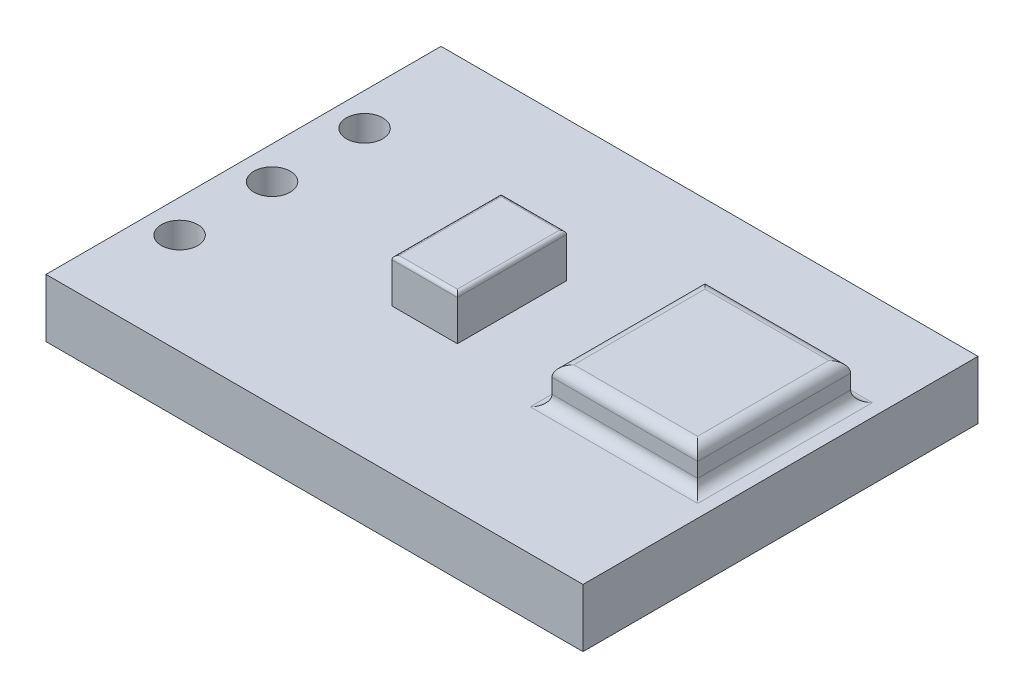
ISO-10303-21;
HEADER;
FILE_DESCRIPTION(('STEP AP214'),'2;1');
FILE_NAME('part.step','',(''),(''),'','','');
FILE_SCHEMA(('AUTOMOTIVE_DESIGN { 1 0 10303 214 1 1 1 1 }'));
ENDSEC;
DATA;
#1=APPLICATION_CONTEXT('core data for automotive mechanical design processes');
#2=APPLICATION_PROTOCOL_DEFINITION('international standard','automotive_design',2000,#1);
#3=PRODUCT_CONTEXT('',#1,'mechanical');
#4=PRODUCT('Part','Part','',(#3));
#5=PRODUCT_RELATED_PRODUCT_CATEGORY('part','',(#4));
#6=PRODUCT_DEFINITION_FORMATION('','',#4);
#7=PRODUCT_DEFINITION_CONTEXT('part definition',#1,'design');
#8=PRODUCT_DEFINITION('design','',#6,#7);
#9=PRODUCT_DEFINITION_SHAPE('','',#8);
#10=(LENGTH_UNIT() NAMED_UNIT(*) SI_UNIT(.MILLI.,.METRE.));
#11=(NAMED_UNIT(*) PLANE_ANGLE_UNIT() SI_UNIT($,.RADIAN.));
#12=(NAMED_UNIT(*) SI_UNIT($,.STERADIAN.) SOLID_ANGLE_UNIT());
#13=UNCERTAINTY_MEASURE_WITH_UNIT(LENGTH_MEASURE(1.E-05),#10,'distance_accuracy_value','');
#14=(GEOMETRIC_REPRESENTATION_CONTEXT(3) GLOBAL_UNCERTAINTY_ASSIGNED_CONTEXT((#13)) GLOBAL_UNIT_ASSIGNED_CONTEXT((#10,
#11,#12)) REPRESENTATION_CONTEXT('',''));
#15=CARTESIAN_POINT('',(0.,0.,0.));
#16=DIRECTION('',(0.,0.,1.));
#17=DIRECTION('',(1.,0.,0.));
#18=AXIS2_PLACEMENT_3D('',#15,#16,#17);
#19=CARTESIAN_POINT('',(0.,1.6,0.));
#20=DIRECTION('',(0.,-1.,0.));
#21=DIRECTION('',(0.,0.,-1.));
#22=AXIS2_PLACEMENT_3D('',#19,#20,#21);
#23=PLANE('',#22);
#24=DIRECTION('',(0.,0.,1.));
#25=VECTOR('',#24,1.);
#26=CARTESIAN_POINT('',(-344.632928539999,1.6,4.01829220130623));
#27=LINE('',#26,#25);
#28=CARTESIAN_POINT('',(-344.632928539999,1.6,8.51829220130623));
#29=VERTEX_POINT('',#28);
#30=CARTESIAN_POINT('',(-344.632928539999,1.6,3.71829220130623));
#31=VERTEX_POINT('',#30);
#32=EDGE_CURVE('E255',#29,#31,#27,.F.);
#33=ORIENTED_EDGE('',*,*,#32,.T.);
#34=DIRECTION('',(1.,0.,0.));
#35=VECTOR('',#34,1.);
#36=CARTESIAN_POINT('',(0.,1.6,3.71829220130623));
#37=LINE('',#36,#35);
#38=CARTESIAN_POINT('',(-340.032928539999,1.6,3.71829220130623));
#39=VERTEX_POINT('',#38);
#40=EDGE_CURVE('E257',#31,#39,#37,.T.);
#41=ORIENTED_EDGE('',*,*,#40,.T.);
#42=DIRECTION('',(0.,0.,1.));
#43=VECTOR('',#42,1.);
#44=CARTESIAN_POINT('',(-340.032928539999,1.6,0.));
#45=LINE('',#44,#43);
#46=CARTESIAN_POINT('',(-340.032928539999,1.6,8.51829220130623));
#47=VERTEX_POINT('',#46);
#48=EDGE_CURVE('E251',#39,#47,#45,.T.);
#49=ORIENTED_EDGE('',*,*,#48,.T.);
#50=DIRECTION('',(1.,0.,0.));
#51=VECTOR('',#50,1.);
#52=CARTESIAN_POINT('',(-344.332928539999,1.6,8.51829220130623));
#53=LINE('',#52,#51);
#54=EDGE_CURVE('E253',#47,#29,#53,.F.);
#55=ORIENTED_EDGE('',*,*,#54,.T.);
#56=EDGE_LOOP('',(#33,#41,#49,#55));
#57=FACE_BOUND('',#56,.T.);
#58=DIRECTION('',(0.,0.,1.));
#59=VECTOR('',#58,1.);
#60=CARTESIAN_POINT('',(-354.432928539998,1.6,12.0182922013062));
#61=LINE('',#60,#59);
#62=CARTESIAN_POINT('',(-354.432928539998,1.6,1.16829220130623));
#63=VERTEX_POINT('',#62);
#64=CARTESIAN_POINT('',(-354.432928539998,1.6,12.0182922013062));
#65=VERTEX_POINT('',#64);
#66=EDGE_CURVE('E222',#63,#65,#61,.T.);
#67=ORIENTED_EDGE('',*,*,#66,.T.);
#68=DIRECTION('',(1.,0.,0.));
#69=VECTOR('',#68,1.);
#70=CARTESIAN_POINT('',(-354.432928539998,1.6,12.0182922013062));
#71=LINE('',#70,#69);
#72=CARTESIAN_POINT('',(-339.682928539999,1.6,12.0182922013062));
#73=VERTEX_POINT('',#72);
#74=EDGE_CURVE('E225',#65,#73,#71,.T.);
#75=ORIENTED_EDGE('',*,*,#74,.T.);
#76=DIRECTION('',(0.,0.,-1.));
#77=VECTOR('',#76,1.);
#78=CARTESIAN_POINT('',(-339.682928539999,1.6,12.0182922013062));
#79=LINE('',#78,#77);
#80=CARTESIAN_POINT('',(-339.682928539999,1.6,1.16829220130623));
#81=VERTEX_POINT('',#80);
#82=EDGE_CURVE('E228',#73,#81,#79,.T.);
#83=ORIENTED_EDGE('',*,*,#82,.T.);
#84=DIRECTION('',(-1.,0.,0.));
#85=VECTOR('',#84,1.);
#86=CARTESIAN_POINT('',(-354.432928539998,1.6,1.16829220130623));
#87=LINE('',#86,#85);
#88=EDGE_CURVE('E230',#81,#63,#87,.T.);
#89=ORIENTED_EDGE('',*,*,#88,.T.);
#90=EDGE_LOOP('',(#67,#75,#83,#89));
#91=FACE_BOUND('',#90,.T.);
#92=CARTESIAN_POINT('',(-353.532928539999,1.6,4.16829220130623));
#93=DIRECTION('',(0.,1.,0.));
#94=DIRECTION('',(0.,0.,1.));
#95=AXIS2_PLACEMENT_3D('',#92,#93,#94);
#96=CIRCLE('',#95,0.500000000000026);
#97=CARTESIAN_POINT('',(-353.532928539999,1.6,4.66829220130626));
#98=VERTEX_POINT('',#97);
#99=EDGE_CURVE('E215',#98,#98,#96,.T.);
#100=ORIENTED_EDGE('',*,*,#99,.F.);
#101=EDGE_LOOP('',(#100));
#102=FACE_BOUND('',#101,.T.);
#103=CARTESIAN_POINT('',(-353.532928539998,1.6,9.24829220130623));
#104=DIRECTION('',(0.,1.,0.));
#105=DIRECTION('',(0.,0.,1.));
#106=AXIS2_PLACEMENT_3D('',#103,#104,#105);
#107=CIRCLE('',#106,0.500000000000026);
#108=CARTESIAN_POINT('',(-353.532928539998,1.6,9.74829220130626));
#109=VERTEX_POINT('',#108);
#110=EDGE_CURVE('E212',#109,#109,#107,.T.);
#111=ORIENTED_EDGE('',*,*,#110,.F.);
#112=EDGE_LOOP('',(#111));
#113=FACE_BOUND('',#112,.T.);
#114=CARTESIAN_POINT('',(-353.532928539999,1.6,6.70829220130623));
#115=DIRECTION('',(0.,1.,0.));
#116=DIRECTION('',(0.,0.,1.));
#117=AXIS2_PLACEMENT_3D('',#114,#115,#116);
#118=CIRCLE('',#117,0.500000000000026);
#119=CARTESIAN_POINT('',(-353.532928539999,1.6,7.20829220130626));
#120=VERTEX_POINT('',#119);
#121=EDGE_CURVE('E206',#120,#120,#118,.T.);
#122=ORIENTED_EDGE('',*,*,#121,.F.);
#123=EDGE_LOOP('',(#122));
#124=FACE_BOUND('',#123,.T.);
#125=DIRECTION('',(0.,0.,1.));
#126=VECTOR('',#125,1.);
#127=CARTESIAN_POINT('',(-348.932928539998,1.6,8.01829220130623));
#128=LINE('',#127,#126);
#129=CARTESIAN_POINT('',(-348.932928539998,1.6,5.01829220130623));
#130=VERTEX_POINT('',#129);
#131=CARTESIAN_POINT('',(-348.932928539998,1.6,8.01829220130623));
#132=VERTEX_POINT('',#131);
#133=EDGE_CURVE('E162',#130,#132,#128,.T.);
#134=ORIENTED_EDGE('',*,*,#133,.F.);
#135=DIRECTION('',(-1.,0.,0.));
#136=VECTOR('',#135,1.);
#137=CARTESIAN_POINT('',(-348.932928539998,1.6,5.01829220130623));
#138=LINE('',#137,#136);
#139=CARTESIAN_POINT('',(-347.132928539998,1.6,5.01829220130623));
#140=VERTEX_POINT('',#139);
#141=EDGE_CURVE('E169',#140,#130,#138,.T.);
#142=ORIENTED_EDGE('',*,*,#141,.F.);
#143=DIRECTION('',(0.,0.,-1.));
#144=VECTOR('',#143,1.);
#145=CARTESIAN_POINT('',(-347.132928539998,1.6,8.01829220130623));
#146=LINE('',#145,#144);
#147=CARTESIAN_POINT('',(-347.132928539998,1.6,8.01829220130623));
#148=VERTEX_POINT('',#147);
#149=EDGE_CURVE('E181',#148,#140,#146,.T.);
#150=ORIENTED_EDGE('',*,*,#149,.F.);
#151=DIRECTION('',(1.,0.,0.));
#152=VECTOR('',#151,1.);
#153=CARTESIAN_POINT('',(-348.932928539998,1.6,8.01829220130623));
#154=LINE('',#153,#152);
#155=EDGE_CURVE('E177',#132,#148,#154,.T.);
#156=ORIENTED_EDGE('',*,*,#155,.F.);
#157=EDGE_LOOP('',(#134,#142,#150,#156));
#158=FACE_BOUND('',#157,.T.);
#159=ADVANCED_FACE('F33',(#57,#91,#102,#113,#124,#158),#23,.F.);
#160=CARTESIAN_POINT('',(-354.432928539998,1.6,12.0182922013062));
#161=DIRECTION('',(1.,0.,0.));
#162=DIRECTION('',(0.,0.,-1.));
#163=AXIS2_PLACEMENT_3D('',#160,#161,#162);
#164=PLANE('',#163);
#165=DIRECTION('',(0.,0.,1.));
#166=VECTOR('',#165,1.);
#167=CARTESIAN_POINT('',(-354.432928539998,0.,12.0182922013062));
#168=LINE('',#167,#166);
#169=CARTESIAN_POINT('',(-354.432928539998,0.,1.16829220130623));
#170=VERTEX_POINT('',#169);
#171=CARTESIAN_POINT('',(-354.432928539998,0.,12.0182922013062));
#172=VERTEX_POINT('',#171);
#173=EDGE_CURVE('E221',#170,#172,#168,.T.);
#174=ORIENTED_EDGE('',*,*,#173,.T.);
#175=DIRECTION('',(0.,-1.,0.));
#176=VECTOR('',#175,1.);
#177=CARTESIAN_POINT('',(-354.432928539998,1.6,12.0182922013062));
#178=LINE('',#177,#176);
#179=EDGE_CURVE('E248',#65,#172,#178,.T.);
#180=ORIENTED_EDGE('',*,*,#179,.F.);
#181=ORIENTED_EDGE('',*,*,#66,.F.);
#182=DIRECTION('',(0.,-1.,0.));
#183=VECTOR('',#182,1.);
#184=CARTESIAN_POINT('',(-354.432928539998,1.6,1.16829220130623));
#185=LINE('',#184,#183);
#186=EDGE_CURVE('E232',#63,#170,#185,.T.);
#187=ORIENTED_EDGE('',*,*,#186,.T.);
#188=EDGE_LOOP('',(#174,#180,#181,#187));
#189=FACE_BOUND('',#188,.T.);
#190=ADVANCED_FACE('F352',(#189),#164,.F.);
#191=CARTESIAN_POINT('',(-354.432928539998,1.6,12.0182922013062));
#192=DIRECTION('',(0.,0.,-1.));
#193=DIRECTION('',(-1.,0.,0.));
#194=AXIS2_PLACEMENT_3D('',#191,#192,#193);
#195=PLANE('',#194);
#196=DIRECTION('',(1.,0.,0.));
#197=VECTOR('',#196,1.);
#198=CARTESIAN_POINT('',(-354.432928539998,0.,12.0182922013062));
#199=LINE('',#198,#197);
#200=CARTESIAN_POINT('',(-339.682928539999,0.,12.0182922013062));
#201=VERTEX_POINT('',#200);
#202=EDGE_CURVE('E235',#172,#201,#199,.T.);
#203=ORIENTED_EDGE('',*,*,#202,.T.);
#204=DIRECTION('',(0.,-1.,0.));
#205=VECTOR('',#204,1.);
#206=CARTESIAN_POINT('',(-339.682928539999,1.6,12.0182922013062));
#207=LINE('',#206,#205);
#208=EDGE_CURVE('E245',#73,#201,#207,.T.);
#209=ORIENTED_EDGE('',*,*,#208,.F.);
#210=ORIENTED_EDGE('',*,*,#74,.F.);
#211=ORIENTED_EDGE('',*,*,#179,.T.);
#212=EDGE_LOOP('',(#203,#209,#210,#211));
#213=FACE_BOUND('',#212,.T.);
#214=ADVANCED_FACE('F358',(#213),#195,.F.);
#215=CARTESIAN_POINT('',(-339.682928539999,1.6,12.0182922013062));
#216=DIRECTION('',(-1.,0.,0.));
#217=DIRECTION('',(0.,0.,1.));
#218=AXIS2_PLACEMENT_3D('',#215,#216,#217);
#219=PLANE('',#218);
#220=DIRECTION('',(0.,0.,-1.));
#221=VECTOR('',#220,1.);
#222=CARTESIAN_POINT('',(-339.682928539999,0.,12.0182922013062));
#223=LINE('',#222,#221);
#224=CARTESIAN_POINT('',(-339.682928539999,0.,1.16829220130623));
#225=VERTEX_POINT('',#224);
#226=EDGE_CURVE('E237',#201,#225,#223,.T.);
#227=ORIENTED_EDGE('',*,*,#226,.T.);
#228=DIRECTION('',(0.,-1.,0.));
#229=VECTOR('',#228,1.);
#230=CARTESIAN_POINT('',(-339.682928539999,1.6,1.16829220130623));
#231=LINE('',#230,#229);
#232=EDGE_CURVE('E242',#81,#225,#231,.T.);
#233=ORIENTED_EDGE('',*,*,#232,.F.);
#234=ORIENTED_EDGE('',*,*,#82,.F.);
#235=ORIENTED_EDGE('',*,*,#208,.T.);
#236=EDGE_LOOP('',(#227,#233,#234,#235));
#237=FACE_BOUND('',#236,.T.);
#238=ADVANCED_FACE('F373',(#237),#219,.F.);
#239=CARTESIAN_POINT('',(-354.432928539998,1.6,1.16829220130623));
#240=DIRECTION('',(0.,0.,1.));
#241=DIRECTION('',(1.,0.,0.));
#242=AXIS2_PLACEMENT_3D('',#239,#240,#241);
#243=PLANE('',#242);
#244=DIRECTION('',(-1.,0.,0.));
#245=VECTOR('',#244,1.);
#246=CARTESIAN_POINT('',(-354.432928539998,0.,1.16829220130623));
#247=LINE('',#246,#245);
#248=EDGE_CURVE('E226',#225,#170,#247,.T.);
#249=ORIENTED_EDGE('',*,*,#248,.T.);
#250=ORIENTED_EDGE('',*,*,#186,.F.);
#251=ORIENTED_EDGE('',*,*,#88,.F.);
#252=ORIENTED_EDGE('',*,*,#232,.T.);
#253=EDGE_LOOP('',(#249,#250,#251,#252));
#254=FACE_BOUND('',#253,.T.);
#255=ADVANCED_FACE('F369',(#254),#243,.F.);
#256=CARTESIAN_POINT('',(0.,0.,0.));
#257=DIRECTION('',(0.,-1.,0.));
#258=DIRECTION('',(0.,0.,-1.));
#259=AXIS2_PLACEMENT_3D('',#256,#257,#258);
#260=PLANE('',#259);
#261=CARTESIAN_POINT('',(-353.532928539999,0.,6.70829220130623));
#262=DIRECTION('',(0.,-1.,0.));
#263=DIRECTION('',(0.,0.,-1.));
#264=AXIS2_PLACEMENT_3D('',#261,#262,#263);
#265=CIRCLE('',#264,0.500000000000026);
#266=CARTESIAN_POINT('',(-353.532928539999,0.,6.2082922013062));
#267=VERTEX_POINT('',#266);
#268=EDGE_CURVE('E195',#267,#267,#265,.F.);
#269=ORIENTED_EDGE('',*,*,#268,.T.);
#270=EDGE_LOOP('',(#269));
#271=FACE_BOUND('',#270,.T.);
#272=CARTESIAN_POINT('',(-353.532928539998,0.,9.24829220130623));
#273=DIRECTION('',(0.,-1.,0.));
#274=DIRECTION('',(0.,0.,-1.));
#275=AXIS2_PLACEMENT_3D('',#272,#273,#274);
#276=CIRCLE('',#275,0.500000000000026);
#277=CARTESIAN_POINT('',(-353.532928539998,0.,8.7482922013062));
#278=VERTEX_POINT('',#277);
#279=EDGE_CURVE('E209',#278,#278,#276,.F.);
#280=ORIENTED_EDGE('',*,*,#279,.T.);
#281=EDGE_LOOP('',(#280));
#282=FACE_BOUND('',#281,.T.);
#283=CARTESIAN_POINT('',(-353.532928539999,0.,4.16829220130623));
#284=DIRECTION('',(0.,-1.,0.));
#285=DIRECTION('',(0.,0.,-1.));
#286=AXIS2_PLACEMENT_3D('',#283,#284,#285);
#287=CIRCLE('',#286,0.500000000000026);
#288=CARTESIAN_POINT('',(-353.532928539999,0.,3.6682922013062));
#289=VERTEX_POINT('',#288);
#290=EDGE_CURVE('E218',#289,#289,#287,.F.);
#291=ORIENTED_EDGE('',*,*,#290,.T.);
#292=EDGE_LOOP('',(#291));
#293=FACE_BOUND('',#292,.T.);
#294=ORIENTED_EDGE('',*,*,#173,.F.);
#295=ORIENTED_EDGE('',*,*,#248,.F.);
#296=ORIENTED_EDGE('',*,*,#226,.F.);
#297=ORIENTED_EDGE('',*,*,#202,.F.);
#298=EDGE_LOOP('',(#294,#295,#296,#297));
#299=FACE_BOUND('',#298,.T.);
#300=ADVANCED_FACE('F366',(#271,#282,#293,#299),#260,.T.);
#301=CARTESIAN_POINT('',(-353.532928539999,-1.41421356237313,4.16829220130623));
#302=DIRECTION('',(0.,1.,0.));
#303=DIRECTION('',(0.,0.,1.));
#304=AXIS2_PLACEMENT_3D('',#301,#302,#303);
#305=CYLINDRICAL_SURFACE('',#304,0.500000000000026);
#306=ORIENTED_EDGE('',*,*,#99,.T.);
#307=EDGE_LOOP('',(#306));
#308=FACE_BOUND('',#307,.T.);
#309=ORIENTED_EDGE('',*,*,#290,.F.);
#310=EDGE_LOOP('',(#309));
#311=FACE_BOUND('',#310,.T.);
#312=ADVANCED_FACE('F364',(#308,#311),#305,.F.);
#313=CARTESIAN_POINT('',(-353.532928539998,-1.41421356237313,9.24829220130623));
#314=DIRECTION('',(0.,1.,0.));
#315=DIRECTION('',(0.,0.,1.));
#316=AXIS2_PLACEMENT_3D('',#313,#314,#315);
#317=CYLINDRICAL_SURFACE('',#316,0.500000000000026);
#318=ORIENTED_EDGE('',*,*,#110,.T.);
#319=EDGE_LOOP('',(#318));
#320=FACE_BOUND('',#319,.T.);
#321=ORIENTED_EDGE('',*,*,#279,.F.);
#322=EDGE_LOOP('',(#321));
#323=FACE_BOUND('',#322,.T.);
#324=ADVANCED_FACE('F531',(#320,#323),#317,.F.);
#325=CARTESIAN_POINT('',(-353.532928539999,-1.41421356237313,6.70829220130623));
#326=DIRECTION('',(0.,1.,0.));
#327=DIRECTION('',(0.,0.,1.));
#328=AXIS2_PLACEMENT_3D('',#325,#326,#327);
#329=CYLINDRICAL_SURFACE('',#328,0.500000000000026);
#330=ORIENTED_EDGE('',*,*,#121,.T.);
#331=EDGE_LOOP('',(#330));
#332=FACE_BOUND('',#331,.T.);
#333=ORIENTED_EDGE('',*,*,#268,.F.);
#334=EDGE_LOOP('',(#333));
#335=FACE_BOUND('',#334,.T.);
#336=ADVANCED_FACE('F523',(#332,#335),#329,.F.);
#337=CARTESIAN_POINT('',(-344.332928539999,2.6,4.01829220130623));
#338=DIRECTION('',(0.,0.,-1.));
#339=DIRECTION('',(-1.,0.,0.));
#340=AXIS2_PLACEMENT_3D('',#337,#338,#339);
#341=PLANE('',#340);
#342=DIRECTION('',(0.,-1.,0.));
#343=VECTOR('',#342,1.);
#344=CARTESIAN_POINT('',(-340.332928539999,2.6,4.01829220130623));
#345=LINE('',#344,#343);
#346=CARTESIAN_POINT('',(-340.332928539999,2.3,4.01829220130623));
#347=VERTEX_POINT('',#346);
#348=CARTESIAN_POINT('',(-340.332928539999,1.9,4.01829220130623));
#349=VERTEX_POINT('',#348);
#350=EDGE_CURVE('E191',#347,#349,#345,.T.);
#351=ORIENTED_EDGE('',*,*,#350,.T.);
#352=DIRECTION('',(1.,0.,0.));
#353=VECTOR('',#352,1.);
#354=CARTESIAN_POINT('',(-344.332928539999,1.9,4.01829220130623));
#355=LINE('',#354,#353);
#356=CARTESIAN_POINT('',(-344.332928539999,1.9,4.01829220130623));
#357=VERTEX_POINT('',#356);
#358=EDGE_CURVE('E263',#349,#357,#355,.F.);
#359=ORIENTED_EDGE('',*,*,#358,.T.);
#360=DIRECTION('',(0.,-1.,0.));
#361=VECTOR('',#360,1.);
#362=CARTESIAN_POINT('',(-344.332928539999,2.6,4.01829220130623));
#363=LINE('',#362,#361);
#364=CARTESIAN_POINT('',(-344.332928539999,2.3,4.01829220130623));
#365=VERTEX_POINT('',#364);
#366=EDGE_CURVE('E192',#365,#357,#363,.T.);
#367=ORIENTED_EDGE('',*,*,#366,.F.);
#368=DIRECTION('',(1.,0.,0.));
#369=VECTOR('',#368,1.);
#370=CARTESIAN_POINT('',(-340.332928539999,2.3,4.01829220130623));
#371=LINE('',#370,#369);
#372=EDGE_CURVE('E260',#365,#347,#371,.T.);
#373=ORIENTED_EDGE('',*,*,#372,.T.);
#374=EDGE_LOOP('',(#351,#359,#367,#373));
#375=FACE_BOUND('',#374,.T.);
#376=ADVANCED_FACE('F515',(#375),#341,.T.);
#377=CARTESIAN_POINT('',(-344.332928539999,2.6,4.01829220130623));
#378=DIRECTION('',(1.,0.,0.));
#379=DIRECTION('',(0.,0.,-1.));
#380=AXIS2_PLACEMENT_3D('',#377,#378,#379);
#381=PLANE('',#380);
#382=ORIENTED_EDGE('',*,*,#366,.T.);
#383=DIRECTION('',(0.,0.,1.));
#384=VECTOR('',#383,1.);
#385=CARTESIAN_POINT('',(-344.332928539999,1.9,8.21829220130623));
#386=LINE('',#385,#384);
#387=CARTESIAN_POINT('',(-344.332928539999,1.9,8.21829220130623));
#388=VERTEX_POINT('',#387);
#389=EDGE_CURVE('E268',#357,#388,#386,.T.);
#390=ORIENTED_EDGE('',*,*,#389,.T.);
#391=DIRECTION('',(0.,-1.,0.));
#392=VECTOR('',#391,1.);
#393=CARTESIAN_POINT('',(-344.332928539999,2.6,8.21829220130623));
#394=LINE('',#393,#392);
#395=CARTESIAN_POINT('',(-344.332928539999,2.3,8.21829220130623));
#396=VERTEX_POINT('',#395);
#397=EDGE_CURVE('E196',#396,#388,#394,.T.);
#398=ORIENTED_EDGE('',*,*,#397,.F.);
#399=DIRECTION('',(0.,0.,1.));
#400=VECTOR('',#399,1.);
#401=CARTESIAN_POINT('',(-344.332928539999,2.3,4.01829220130623));
#402=LINE('',#401,#400);
#403=EDGE_CURVE('E266',#396,#365,#402,.F.);
#404=ORIENTED_EDGE('',*,*,#403,.T.);
#405=EDGE_LOOP('',(#382,#390,#398,#404));
#406=FACE_BOUND('',#405,.T.);
#407=ADVANCED_FACE('F507',(#406),#381,.F.);
#408=CARTESIAN_POINT('',(-344.332928539999,2.6,8.21829220130623));
#409=DIRECTION('',(0.,0.,-1.));
#410=DIRECTION('',(-1.,0.,0.));
#411=AXIS2_PLACEMENT_3D('',#408,#409,#410);
#412=PLANE('',#411);
#413=ORIENTED_EDGE('',*,*,#397,.T.);
#414=DIRECTION('',(1.,0.,0.));
#415=VECTOR('',#414,1.);
#416=CARTESIAN_POINT('',(-340.332928539999,1.9,8.21829220130623));
#417=LINE('',#416,#415);
#418=CARTESIAN_POINT('',(-340.332928539999,1.9,8.21829220130623));
#419=VERTEX_POINT('',#418);
#420=EDGE_CURVE('E272',#388,#419,#417,.T.);
#421=ORIENTED_EDGE('',*,*,#420,.T.);
#422=DIRECTION('',(0.,-1.,0.));
#423=VECTOR('',#422,1.);
#424=CARTESIAN_POINT('',(-340.332928539999,2.6,8.21829220130623));
#425=LINE('',#424,#423);
#426=CARTESIAN_POINT('',(-340.332928539999,2.3,8.21829220130623));
#427=VERTEX_POINT('',#426);
#428=EDGE_CURVE('E199',#427,#419,#425,.T.);
#429=ORIENTED_EDGE('',*,*,#428,.F.);
#430=DIRECTION('',(1.,0.,0.));
#431=VECTOR('',#430,1.);
#432=CARTESIAN_POINT('',(-344.332928539999,2.3,8.21829220130623));
#433=LINE('',#432,#431);
#434=EDGE_CURVE('E270',#427,#396,#433,.F.);
#435=ORIENTED_EDGE('',*,*,#434,.T.);
#436=EDGE_LOOP('',(#413,#421,#429,#435));
#437=FACE_BOUND('',#436,.T.);
#438=ADVANCED_FACE('F499',(#437),#412,.F.);
#439=CARTESIAN_POINT('',(-340.332928539999,2.6,4.01829220130623));
#440=DIRECTION('',(1.,0.,0.));
#441=DIRECTION('',(0.,0.,-1.));
#442=AXIS2_PLACEMENT_3D('',#439,#440,#441);
#443=PLANE('',#442);
#444=ORIENTED_EDGE('',*,*,#428,.T.);
#445=DIRECTION('',(0.,0.,1.));
#446=VECTOR('',#445,1.);
#447=CARTESIAN_POINT('',(-340.332928539999,1.9,4.01829220130623));
#448=LINE('',#447,#446);
#449=EDGE_CURVE('E276',#419,#349,#448,.F.);
#450=ORIENTED_EDGE('',*,*,#449,.T.);
#451=ORIENTED_EDGE('',*,*,#350,.F.);
#452=DIRECTION('',(0.,0.,1.));
#453=VECTOR('',#452,1.);
#454=CARTESIAN_POINT('',(-340.332928539999,2.3,8.21829220130623));
#455=LINE('',#454,#453);
#456=EDGE_CURVE('E274',#347,#427,#455,.T.);
#457=ORIENTED_EDGE('',*,*,#456,.T.);
#458=EDGE_LOOP('',(#444,#450,#451,#457));
#459=FACE_BOUND('',#458,.T.);
#460=ADVANCED_FACE('F491',(#459),#443,.T.);
#461=CARTESIAN_POINT('',(0.,2.6,0.));
#462=DIRECTION('',(0.,-1.,0.));
#463=DIRECTION('',(0.,0.,-1.));
#464=AXIS2_PLACEMENT_3D('',#461,#462,#463);
#465=PLANE('',#464);
#466=DIRECTION('',(0.,0.,1.));
#467=VECTOR('',#466,1.);
#468=CARTESIAN_POINT('',(-340.632928539999,2.6,4.01829220130623));
#469=LINE('',#468,#467);
#470=CARTESIAN_POINT('',(-340.632928539999,2.6,7.91829220130623));
#471=VERTEX_POINT('',#470);
#472=CARTESIAN_POINT('',(-340.632928539999,2.6,4.31829220130623));
#473=VERTEX_POINT('',#472);
#474=EDGE_CURVE('E282',#471,#473,#469,.F.);
#475=ORIENTED_EDGE('',*,*,#474,.T.);
#476=DIRECTION('',(1.,0.,0.));
#477=VECTOR('',#476,1.);
#478=CARTESIAN_POINT('',(-344.332928539999,2.6,4.31829220130623));
#479=LINE('',#478,#477);
#480=CARTESIAN_POINT('',(-344.032928539999,2.6,4.31829220130623));
#481=VERTEX_POINT('',#480);
#482=EDGE_CURVE('E284',#473,#481,#479,.F.);
#483=ORIENTED_EDGE('',*,*,#482,.T.);
#484=DIRECTION('',(0.,0.,1.));
#485=VECTOR('',#484,1.);
#486=CARTESIAN_POINT('',(-344.032928539999,2.6,0.));
#487=LINE('',#486,#485);
#488=CARTESIAN_POINT('',(-344.032928539999,2.6,7.91829220130623));
#489=VERTEX_POINT('',#488);
#490=EDGE_CURVE('E278',#481,#489,#487,.T.);
#491=ORIENTED_EDGE('',*,*,#490,.T.);
#492=DIRECTION('',(1.,0.,0.));
#493=VECTOR('',#492,1.);
#494=CARTESIAN_POINT('',(0.,2.6,7.91829220130623));
#495=LINE('',#494,#493);
#496=EDGE_CURVE('E280',#489,#471,#495,.T.);
#497=ORIENTED_EDGE('',*,*,#496,.T.);
#498=EDGE_LOOP('',(#475,#483,#491,#497));
#499=FACE_BOUND('',#498,.T.);
#500=ADVANCED_FACE('F349',(#499),#465,.F.);
#501=CARTESIAN_POINT('',(-348.932928539998,2.8,8.01829220130623));
#502=DIRECTION('',(1.,0.,0.));
#503=DIRECTION('',(0.,0.,-1.));
#504=AXIS2_PLACEMENT_3D('',#501,#502,#503);
#505=PLANE('',#504);
#506=DIRECTION('',(0.,-1.,0.));
#507=VECTOR('',#506,1.);
#508=CARTESIAN_POINT('',(-348.932928539998,2.8,8.01829220130623));
#509=LINE('',#508,#507);
#510=CARTESIAN_POINT('',(-348.932928539998,2.7,8.01829220130623));
#511=VERTEX_POINT('',#510);
#512=EDGE_CURVE('E189',#511,#132,#509,.T.);
#513=ORIENTED_EDGE('',*,*,#512,.F.);
#514=DIRECTION('',(0.,0.,1.));
#515=VECTOR('',#514,1.);
#516=CARTESIAN_POINT('',(-348.932928539998,2.7,8.01829220130623));
#517=LINE('',#516,#515);
#518=CARTESIAN_POINT('',(-348.932928539998,2.7,5.01829220130623));
#519=VERTEX_POINT('',#518);
#520=EDGE_CURVE('E11',#511,#519,#517,.F.);
#521=ORIENTED_EDGE('',*,*,#520,.T.);
#522=DIRECTION('',(0.,-1.,0.));
#523=VECTOR('',#522,1.);
#524=CARTESIAN_POINT('',(-348.932928539998,2.8,5.01829220130623));
#525=LINE('',#524,#523);
#526=EDGE_CURVE('E159',#519,#130,#525,.T.);
#527=ORIENTED_EDGE('',*,*,#526,.T.);
#528=ORIENTED_EDGE('',*,*,#133,.T.);
#529=EDGE_LOOP('',(#513,#521,#527,#528));
#530=FACE_BOUND('',#529,.T.);
#531=ADVANCED_FACE('F161',(#530),#505,.F.);
#532=CARTESIAN_POINT('',(-348.932928539998,2.8,8.01829220130623));
#533=DIRECTION('',(0.,0.,-1.));
#534=DIRECTION('',(-1.,0.,0.));
#535=AXIS2_PLACEMENT_3D('',#532,#533,#534);
#536=PLANE('',#535);
#537=DIRECTION('',(0.,-1.,0.));
#538=VECTOR('',#537,1.);
#539=CARTESIAN_POINT('',(-347.132928539998,2.8,8.01829220130623));
#540=LINE('',#539,#538);
#541=CARTESIAN_POINT('',(-347.132928539998,2.7,8.01829220130623));
#542=VERTEX_POINT('',#541);
#543=EDGE_CURVE('E187',#542,#148,#540,.T.);
#544=ORIENTED_EDGE('',*,*,#543,.F.);
#545=DIRECTION('',(1.,0.,0.));
#546=VECTOR('',#545,1.);
#547=CARTESIAN_POINT('',(-348.932928539998,2.7,8.01829220130623));
#548=LINE('',#547,#546);
#549=EDGE_CURVE('E42',#542,#511,#548,.F.);
#550=ORIENTED_EDGE('',*,*,#549,.T.);
#551=ORIENTED_EDGE('',*,*,#512,.T.);
#552=ORIENTED_EDGE('',*,*,#155,.T.);
#553=EDGE_LOOP('',(#544,#550,#551,#552));
#554=FACE_BOUND('',#553,.T.);
#555=ADVANCED_FACE('F341',(#554),#536,.F.);
#556=CARTESIAN_POINT('',(-347.132928539998,2.8,8.01829220130623));
#557=DIRECTION('',(-1.,0.,0.));
#558=DIRECTION('',(0.,0.,1.));
#559=AXIS2_PLACEMENT_3D('',#556,#557,#558);
#560=PLANE('',#559);
#561=DIRECTION('',(0.,-1.,0.));
#562=VECTOR('',#561,1.);
#563=CARTESIAN_POINT('',(-347.132928539998,2.8,5.01829220130623));
#564=LINE('',#563,#562);
#565=CARTESIAN_POINT('',(-347.132928539998,2.7,5.01829220130623));
#566=VERTEX_POINT('',#565);
#567=EDGE_CURVE('E168',#566,#140,#564,.T.);
#568=ORIENTED_EDGE('',*,*,#567,.F.);
#569=DIRECTION('',(0.,0.,-1.));
#570=VECTOR('',#569,1.);
#571=CARTESIAN_POINT('',(-347.132928539998,2.7,8.01829220130623));
#572=LINE('',#571,#570);
#573=EDGE_CURVE('E57',#566,#542,#572,.F.);
#574=ORIENTED_EDGE('',*,*,#573,.T.);
#575=ORIENTED_EDGE('',*,*,#543,.T.);
#576=ORIENTED_EDGE('',*,*,#149,.T.);
#577=EDGE_LOOP('',(#568,#574,#575,#576));
#578=FACE_BOUND('',#577,.T.);
#579=ADVANCED_FACE('F340',(#578),#560,.F.);
#580=CARTESIAN_POINT('',(-348.932928539998,2.8,5.01829220130623));
#581=DIRECTION('',(0.,0.,1.));
#582=DIRECTION('',(1.,0.,0.));
#583=AXIS2_PLACEMENT_3D('',#580,#581,#582);
#584=PLANE('',#583);
#585=ORIENTED_EDGE('',*,*,#526,.F.);
#586=DIRECTION('',(-1.,0.,0.));
#587=VECTOR('',#586,1.);
#588=CARTESIAN_POINT('',(-348.932928539998,2.7,5.01829220130623));
#589=LINE('',#588,#587);
#590=EDGE_CURVE('E315',#519,#566,#589,.F.);
#591=ORIENTED_EDGE('',*,*,#590,.T.);
#592=ORIENTED_EDGE('',*,*,#567,.T.);
#593=ORIENTED_EDGE('',*,*,#141,.T.);
#594=EDGE_LOOP('',(#585,#591,#592,#593));
#595=FACE_BOUND('',#594,.T.);
#596=ADVANCED_FACE('F180',(#595),#584,.F.);
#597=CARTESIAN_POINT('',(0.,2.8,0.));
#598=DIRECTION('',(0.,-1.,0.));
#599=DIRECTION('',(0.,0.,-1.));
#600=AXIS2_PLACEMENT_3D('',#597,#598,#599);
#601=PLANE('',#600);
#602=DIRECTION('',(0.,0.,-1.));
#603=VECTOR('',#602,1.);
#604=CARTESIAN_POINT('',(-347.232928539999,2.8,0.));
#605=LINE('',#604,#603);
#606=CARTESIAN_POINT('',(-347.232928539999,2.8,7.91829220130623));
#607=VERTEX_POINT('',#606);
#608=CARTESIAN_POINT('',(-347.232928539999,2.8,5.11829220130623));
#609=VERTEX_POINT('',#608);
#610=EDGE_CURVE('E310',#607,#609,#605,.T.);
#611=ORIENTED_EDGE('',*,*,#610,.T.);
#612=DIRECTION('',(-1.,0.,0.));
#613=VECTOR('',#612,1.);
#614=CARTESIAN_POINT('',(0.,2.8,5.11829220130589));
#615=LINE('',#614,#613);
#616=CARTESIAN_POINT('',(-348.832928539999,2.8,5.11829220130623));
#617=VERTEX_POINT('',#616);
#618=EDGE_CURVE('E312',#609,#617,#615,.T.);
#619=ORIENTED_EDGE('',*,*,#618,.T.);
#620=DIRECTION('',(0.,0.,1.));
#621=VECTOR('',#620,1.);
#622=CARTESIAN_POINT('',(-348.832928539999,2.8,0.));
#623=LINE('',#622,#621);
#624=CARTESIAN_POINT('',(-348.832928539999,2.8,7.91829220130623));
#625=VERTEX_POINT('',#624);
#626=EDGE_CURVE('E287',#617,#625,#623,.T.);
#627=ORIENTED_EDGE('',*,*,#626,.T.);
#628=DIRECTION('',(1.,0.,0.));
#629=VECTOR('',#628,1.);
#630=CARTESIAN_POINT('',(0.,2.8,7.91829220130623));
#631=LINE('',#630,#629);
#632=EDGE_CURVE('E308',#625,#607,#631,.T.);
#633=ORIENTED_EDGE('',*,*,#632,.T.);
#634=EDGE_LOOP('',(#611,#619,#627,#633));
#635=FACE_BOUND('',#634,.T.);
#636=ADVANCED_FACE('F397',(#635),#601,.F.);
#637=CARTESIAN_POINT('',(-344.332928539999,1.9,8.51829220130623));
#638=DIRECTION('',(-1.,0.,0.));
#639=DIRECTION('',(0.,0.,1.));
#640=AXIS2_PLACEMENT_3D('',#637,#638,#639);
#641=CYLINDRICAL_SURFACE('',#640,0.3);
#642=CARTESIAN_POINT('',(-340.032928539999,1.9,8.51829220130623));
#643=DIRECTION('',(-0.707106781186547,0.,0.707106781186547));
#644=DIRECTION('',(0.707106781186547,0.,0.707106781186547));
#645=AXIS2_PLACEMENT_3D('',#642,#643,#644);
#646=ELLIPSE('',#645,0.424264068711928,0.3);
#647=EDGE_CURVE('E293',#419,#47,#646,.T.);
#648=ORIENTED_EDGE('',*,*,#647,.F.);
#649=ORIENTED_EDGE('',*,*,#420,.F.);
#650=CARTESIAN_POINT('',(-344.632928539999,1.9,8.51829220130623));
#651=DIRECTION('',(-0.707106781186547,0.,-0.707106781186547));
#652=DIRECTION('',(-0.707106781186547,0.,0.707106781186547));
#653=AXIS2_PLACEMENT_3D('',#650,#651,#652);
#654=ELLIPSE('',#653,0.424264068711928,0.3);
#655=EDGE_CURVE('E178',#29,#388,#654,.F.);
#656=ORIENTED_EDGE('',*,*,#655,.F.);
#657=ORIENTED_EDGE('',*,*,#54,.F.);
#658=EDGE_LOOP('',(#648,#649,#656,#657));
#659=FACE_BOUND('',#658,.T.);
#660=ADVANCED_FACE('F393',(#659),#641,.F.);
#661=CARTESIAN_POINT('',(-344.632928539999,1.9,4.01829220130623));
#662=DIRECTION('',(0.,0.,-1.));
#663=DIRECTION('',(-1.,0.,0.));
#664=AXIS2_PLACEMENT_3D('',#661,#662,#663);
#665=CYLINDRICAL_SURFACE('',#664,0.3);
#666=ORIENTED_EDGE('',*,*,#655,.T.);
#667=ORIENTED_EDGE('',*,*,#389,.F.);
#668=CARTESIAN_POINT('',(-344.632928539999,1.9,3.71829220130623));
#669=DIRECTION('',(0.707106781186547,0.,-0.707106781186547));
#670=DIRECTION('',(-0.707106781186547,0.,-0.707106781186547));
#671=AXIS2_PLACEMENT_3D('',#668,#669,#670);
#672=ELLIPSE('',#671,0.424264068711928,0.3);
#673=EDGE_CURVE('E290',#31,#357,#672,.F.);
#674=ORIENTED_EDGE('',*,*,#673,.F.);
#675=ORIENTED_EDGE('',*,*,#32,.F.);
#676=EDGE_LOOP('',(#666,#667,#674,#675));
#677=FACE_BOUND('',#676,.T.);
#678=ADVANCED_FACE('F389',(#677),#665,.F.);
#679=CARTESIAN_POINT('',(-340.032928539999,1.9,0.));
#680=DIRECTION('',(0.,0.,1.));
#681=DIRECTION('',(1.,0.,0.));
#682=AXIS2_PLACEMENT_3D('',#679,#680,#681);
#683=CYLINDRICAL_SURFACE('',#682,0.3);
#684=ORIENTED_EDGE('',*,*,#647,.T.);
#685=ORIENTED_EDGE('',*,*,#48,.F.);
#686=CARTESIAN_POINT('',(-340.032928539999,1.9,3.71829220130623));
#687=DIRECTION('',(0.707106781186547,0.,0.707106781186547));
#688=DIRECTION('',(-0.707106781186547,0.,0.707106781186547));
#689=AXIS2_PLACEMENT_3D('',#686,#687,#688);
#690=ELLIPSE('',#689,0.424264068711928,0.3);
#691=EDGE_CURVE('E288',#349,#39,#690,.T.);
#692=ORIENTED_EDGE('',*,*,#691,.F.);
#693=ORIENTED_EDGE('',*,*,#449,.F.);
#694=EDGE_LOOP('',(#684,#685,#692,#693));
#695=FACE_BOUND('',#694,.T.);
#696=ADVANCED_FACE('F385',(#695),#683,.F.);
#697=CARTESIAN_POINT('',(0.,1.9,3.71829220130623));
#698=DIRECTION('',(1.,0.,0.));
#699=DIRECTION('',(0.,0.,-1.));
#700=AXIS2_PLACEMENT_3D('',#697,#698,#699);
#701=CYLINDRICAL_SURFACE('',#700,0.3);
#702=ORIENTED_EDGE('',*,*,#673,.T.);
#703=ORIENTED_EDGE('',*,*,#358,.F.);
#704=ORIENTED_EDGE('',*,*,#691,.T.);
#705=ORIENTED_EDGE('',*,*,#40,.F.);
#706=EDGE_LOOP('',(#702,#703,#704,#705));
#707=FACE_BOUND('',#706,.T.);
#708=ADVANCED_FACE('F381',(#707),#701,.F.);
#709=CARTESIAN_POINT('',(0.,2.3,7.91829220130623));
#710=DIRECTION('',(1.,0.,0.));
#711=DIRECTION('',(0.,0.,-1.));
#712=AXIS2_PLACEMENT_3D('',#709,#710,#711);
#713=CYLINDRICAL_SURFACE('',#712,0.3);
#714=CARTESIAN_POINT('',(-340.632928539999,2.3,7.91829220130623));
#715=DIRECTION('',(0.707106781186547,0.,-0.707106781186547));
#716=DIRECTION('',(0.707106781186547,0.,0.707106781186547));
#717=AXIS2_PLACEMENT_3D('',#714,#715,#716);
#718=ELLIPSE('',#717,0.424264068711928,0.3);
#719=EDGE_CURVE('E302',#471,#427,#718,.T.);
#720=ORIENTED_EDGE('',*,*,#719,.F.);
#721=ORIENTED_EDGE('',*,*,#496,.F.);
#722=CARTESIAN_POINT('',(-344.032928539999,2.3,7.91829220130623));
#723=DIRECTION('',(0.707106781186547,0.,0.707106781186547));
#724=DIRECTION('',(-0.707106781186547,0.,0.707106781186547));
#725=AXIS2_PLACEMENT_3D('',#722,#723,#724);
#726=ELLIPSE('',#725,0.424264068711928,0.3);
#727=EDGE_CURVE('E291',#396,#489,#726,.F.);
#728=ORIENTED_EDGE('',*,*,#727,.F.);
#729=ORIENTED_EDGE('',*,*,#434,.F.);
#730=EDGE_LOOP('',(#720,#721,#728,#729));
#731=FACE_BOUND('',#730,.T.);
#732=ADVANCED_FACE('F384',(#731),#713,.T.);
#733=CARTESIAN_POINT('',(-344.032928539999,2.3,0.));
#734=DIRECTION('',(0.,0.,1.));
#735=DIRECTION('',(1.,0.,0.));
#736=AXIS2_PLACEMENT_3D('',#733,#734,#735);
#737=CYLINDRICAL_SURFACE('',#736,0.3);
#738=ORIENTED_EDGE('',*,*,#727,.T.);
#739=ORIENTED_EDGE('',*,*,#490,.F.);
#740=CARTESIAN_POINT('',(-344.032928539999,2.3,4.31829220130623));
#741=DIRECTION('',(-0.707106781186547,0.,0.707106781186547));
#742=DIRECTION('',(0.707106781186547,0.,0.707106781186547));
#743=AXIS2_PLACEMENT_3D('',#740,#741,#742);
#744=ELLIPSE('',#743,0.424264068711928,0.3);
#745=EDGE_CURVE('E300',#365,#481,#744,.F.);
#746=ORIENTED_EDGE('',*,*,#745,.F.);
#747=ORIENTED_EDGE('',*,*,#403,.F.);
#748=EDGE_LOOP('',(#738,#739,#746,#747));
#749=FACE_BOUND('',#748,.T.);
#750=ADVANCED_FACE('F406',(#749),#737,.T.);
#751=CARTESIAN_POINT('',(-340.632928539999,2.3,4.01829220130623));
#752=DIRECTION('',(0.,0.,-1.));
#753=DIRECTION('',(-1.,0.,0.));
#754=AXIS2_PLACEMENT_3D('',#751,#752,#753);
#755=CYLINDRICAL_SURFACE('',#754,0.3);
#756=ORIENTED_EDGE('',*,*,#719,.T.);
#757=ORIENTED_EDGE('',*,*,#456,.F.);
#758=CARTESIAN_POINT('',(-340.632928539999,2.3,4.31829220130623));
#759=DIRECTION('',(-0.707106781186547,0.,-0.707106781186547));
#760=DIRECTION('',(0.707106781186547,0.,-0.707106781186547));
#761=AXIS2_PLACEMENT_3D('',#758,#759,#760);
#762=ELLIPSE('',#761,0.424264068711928,0.3);
#763=EDGE_CURVE('E298',#473,#347,#762,.T.);
#764=ORIENTED_EDGE('',*,*,#763,.F.);
#765=ORIENTED_EDGE('',*,*,#474,.F.);
#766=EDGE_LOOP('',(#756,#757,#764,#765));
#767=FACE_BOUND('',#766,.T.);
#768=ADVANCED_FACE('F402',(#767),#755,.T.);
#769=CARTESIAN_POINT('',(-344.332928539999,2.3,4.31829220130623));
#770=DIRECTION('',(-1.,0.,0.));
#771=DIRECTION('',(0.,0.,1.));
#772=AXIS2_PLACEMENT_3D('',#769,#770,#771);
#773=CYLINDRICAL_SURFACE('',#772,0.3);
#774=ORIENTED_EDGE('',*,*,#745,.T.);
#775=ORIENTED_EDGE('',*,*,#482,.F.);
#776=ORIENTED_EDGE('',*,*,#763,.T.);
#777=ORIENTED_EDGE('',*,*,#372,.F.);
#778=EDGE_LOOP('',(#774,#775,#776,#777));
#779=FACE_BOUND('',#778,.T.);
#780=ADVANCED_FACE('F399',(#779),#773,.T.);
#781=CARTESIAN_POINT('',(0.,2.7,7.91829220130623));
#782=DIRECTION('',(1.,0.,0.));
#783=DIRECTION('',(0.,0.,-1.));
#784=AXIS2_PLACEMENT_3D('',#781,#782,#783);
#785=CYLINDRICAL_SURFACE('',#784,0.1);
#786=CARTESIAN_POINT('',(-348.832928539999,2.7,7.91829220130623));
#787=DIRECTION('',(0.707106781186547,0.,0.707106781186547));
#788=DIRECTION('',(-0.707106781186547,0.,0.707106781186547));
#789=AXIS2_PLACEMENT_3D('',#786,#787,#788);
#790=ELLIPSE('',#789,0.14142135623731,0.1);
#791=EDGE_CURVE('E322',#511,#625,#790,.F.);
#792=ORIENTED_EDGE('',*,*,#791,.F.);
#793=ORIENTED_EDGE('',*,*,#549,.F.);
#794=CARTESIAN_POINT('',(-347.232928539999,2.7,7.91829220130623));
#795=DIRECTION('',(0.707106781186547,0.,-0.707106781186547));
#796=DIRECTION('',(0.707106781186547,0.,0.707106781186547));
#797=AXIS2_PLACEMENT_3D('',#794,#795,#796);
#798=ELLIPSE('',#797,0.14142135623731,0.1);
#799=EDGE_CURVE('E37',#607,#542,#798,.T.);
#800=ORIENTED_EDGE('',*,*,#799,.F.);
#801=ORIENTED_EDGE('',*,*,#632,.F.);
#802=EDGE_LOOP('',(#792,#793,#800,#801));
#803=FACE_BOUND('',#802,.T.);
#804=ADVANCED_FACE('F35',(#803),#785,.T.);
#805=CARTESIAN_POINT('',(-347.232928539999,2.7,0.));
#806=DIRECTION('',(0.,0.,-1.));
#807=DIRECTION('',(-1.,0.,0.));
#808=AXIS2_PLACEMENT_3D('',#805,#806,#807);
#809=CYLINDRICAL_SURFACE('',#808,0.1);
#810=ORIENTED_EDGE('',*,*,#799,.T.);
#811=ORIENTED_EDGE('',*,*,#573,.F.);
#812=CARTESIAN_POINT('',(-347.232928539999,2.7,5.11829220130623));
#813=DIRECTION('',(-0.707106781186548,0.,-0.707106781186547));
#814=DIRECTION('',(0.707106781186547,0.,-0.707106781186548));
#815=AXIS2_PLACEMENT_3D('',#812,#813,#814);
#816=ELLIPSE('',#815,0.14142135623731,0.1);
#817=EDGE_CURVE('E321',#609,#566,#816,.T.);
#818=ORIENTED_EDGE('',*,*,#817,.F.);
#819=ORIENTED_EDGE('',*,*,#610,.F.);
#820=EDGE_LOOP('',(#810,#811,#818,#819));
#821=FACE_BOUND('',#820,.T.);
#822=ADVANCED_FACE('F331',(#821),#809,.T.);
#823=CARTESIAN_POINT('',(-348.832928539999,2.7,0.));
#824=DIRECTION('',(0.,0.,1.));
#825=DIRECTION('',(1.,0.,0.));
#826=AXIS2_PLACEMENT_3D('',#823,#824,#825);
#827=CYLINDRICAL_SURFACE('',#826,0.1);
#828=ORIENTED_EDGE('',*,*,#791,.T.);
#829=ORIENTED_EDGE('',*,*,#626,.F.);
#830=CARTESIAN_POINT('',(-348.832928539999,2.7,5.11829220130623));
#831=DIRECTION('',(-0.707106781186547,0.,0.707106781186548));
#832=DIRECTION('',(0.707106781186548,0.,0.707106781186547));
#833=AXIS2_PLACEMENT_3D('',#830,#831,#832);
#834=ELLIPSE('',#833,0.141421356237309,0.1);
#835=EDGE_CURVE('E319',#519,#617,#834,.F.);
#836=ORIENTED_EDGE('',*,*,#835,.F.);
#837=ORIENTED_EDGE('',*,*,#520,.F.);
#838=EDGE_LOOP('',(#828,#829,#836,#837));
#839=FACE_BOUND('',#838,.T.);
#840=ADVANCED_FACE('F336',(#839),#827,.T.);
#841=CARTESIAN_POINT('',(0.,2.7,5.11829220130589));
#842=DIRECTION('',(-1.,0.,0.));
#843=DIRECTION('',(0.,0.,1.));
#844=AXIS2_PLACEMENT_3D('',#841,#842,#843);
#845=CYLINDRICAL_SURFACE('',#844,0.1);
#846=ORIENTED_EDGE('',*,*,#817,.T.);
#847=ORIENTED_EDGE('',*,*,#590,.F.);
#848=ORIENTED_EDGE('',*,*,#835,.T.);
#849=ORIENTED_EDGE('',*,*,#618,.F.);
#850=EDGE_LOOP('',(#846,#847,#848,#849));
#851=FACE_BOUND('',#850,.T.);
#852=ADVANCED_FACE('F339',(#851),#845,.T.);
#853=CLOSED_SHELL('',(#159,#190,#214,#238,#255,#300,#312,#324,#336,#376,#407,#438,#460,#500,
#531,#555,#579,#596,#636,#660,#678,#696,#708,#732,#750,#768,#780,#804,#822,#840,#852));
#854=MANIFOLD_SOLID_BREP('B2',#853);
#855=ADVANCED_BREP_SHAPE_REPRESENTATION('',(#18,#854),#14);
#856=SHAPE_DEFINITION_REPRESENTATION(#9,#855);
ENDSEC;
END-ISO-10303-21;
